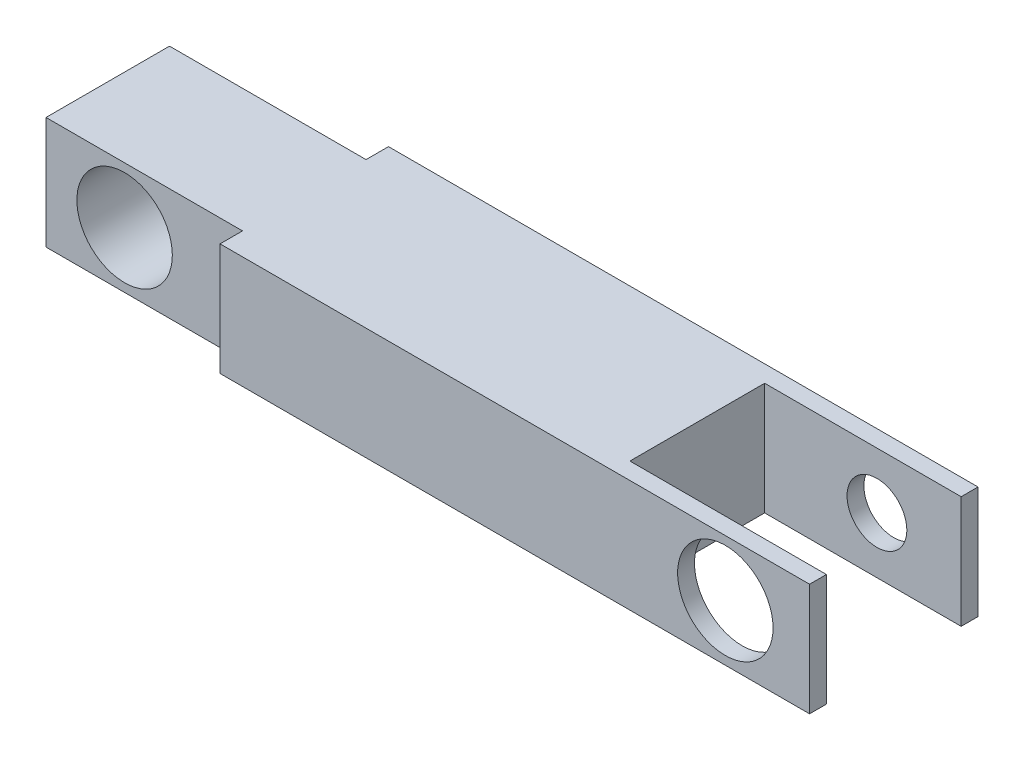
ISO-10303-21;
HEADER;
FILE_DESCRIPTION(('STEP AP214'),'2;1');
FILE_NAME('part.step','',(''),(''),'','','');
FILE_SCHEMA(('AUTOMOTIVE_DESIGN { 1 0 10303 214 1 1 1 1 }'));
ENDSEC;
DATA;
#1=APPLICATION_CONTEXT('core data for automotive mechanical design processes');
#2=APPLICATION_PROTOCOL_DEFINITION('international standard','automotive_design',2000,#1);
#3=PRODUCT_CONTEXT('',#1,'mechanical');
#4=PRODUCT('Part','Part','',(#3));
#5=PRODUCT_RELATED_PRODUCT_CATEGORY('part','',(#4));
#6=PRODUCT_DEFINITION_FORMATION('','',#4);
#7=PRODUCT_DEFINITION_CONTEXT('part definition',#1,'design');
#8=PRODUCT_DEFINITION('design','',#6,#7);
#9=PRODUCT_DEFINITION_SHAPE('','',#8);
#10=(LENGTH_UNIT() NAMED_UNIT(*) SI_UNIT(.MILLI.,.METRE.));
#11=(NAMED_UNIT(*) PLANE_ANGLE_UNIT() SI_UNIT($,.RADIAN.));
#12=(NAMED_UNIT(*) SI_UNIT($,.STERADIAN.) SOLID_ANGLE_UNIT());
#13=UNCERTAINTY_MEASURE_WITH_UNIT(LENGTH_MEASURE(1.E-05),#10,'distance_accuracy_value','');
#14=(GEOMETRIC_REPRESENTATION_CONTEXT(3) GLOBAL_UNCERTAINTY_ASSIGNED_CONTEXT((#13)) GLOBAL_UNIT_ASSIGNED_CONTEXT((#10,
#11,#12)) REPRESENTATION_CONTEXT('',''));
#15=CARTESIAN_POINT('',(0.,0.,0.));
#16=DIRECTION('',(0.,0.,1.));
#17=DIRECTION('',(1.,0.,0.));
#18=AXIS2_PLACEMENT_3D('',#15,#16,#17);
#19=CARTESIAN_POINT('',(-36.9598637191981,-2.27521749465176,7.62));
#20=DIRECTION('',(0.,-1.,0.));
#21=DIRECTION('',(1.,0.,0.));
#22=AXIS2_PLACEMENT_3D('',#19,#20,#21);
#23=PLANE('',#22);
#24=DIRECTION('',(1.,0.,0.));
#25=VECTOR('',#24,1.);
#26=CARTESIAN_POINT('',(0.,-2.27521749465176,6.858));
#27=LINE('',#26,#25);
#28=CARTESIAN_POINT('',(-45.8498637191981,-2.27521749465176,6.858));
#29=VERTEX_POINT('',#28);
#30=CARTESIAN_POINT('',(-36.9598637191981,-2.27521749465176,6.858));
#31=VERTEX_POINT('',#30);
#32=EDGE_CURVE('E137',#29,#31,#27,.T.);
#33=ORIENTED_EDGE('',*,*,#32,.F.);
#34=DIRECTION('',(0.,0.,1.));
#35=VECTOR('',#34,1.);
#36=CARTESIAN_POINT('',(-45.8498637191981,-2.27521749465176,0.));
#37=LINE('',#36,#35);
#38=CARTESIAN_POINT('',(-45.8498637191981,-2.27521749465176,0.761999999999998));
#39=VERTEX_POINT('',#38);
#40=EDGE_CURVE('E126',#39,#29,#37,.T.);
#41=ORIENTED_EDGE('',*,*,#40,.F.);
#42=DIRECTION('',(-1.,0.,0.));
#43=VECTOR('',#42,1.);
#44=CARTESIAN_POINT('',(0.,-2.27521749465176,0.762000000000001));
#45=LINE('',#44,#43);
#46=CARTESIAN_POINT('',(-36.9598637191981,-2.27521749465176,0.761999999999999));
#47=VERTEX_POINT('',#46);
#48=EDGE_CURVE('E136',#47,#39,#45,.T.);
#49=ORIENTED_EDGE('',*,*,#48,.F.);
#50=DIRECTION('',(0.,0.,-1.));
#51=VECTOR('',#50,1.);
#52=CARTESIAN_POINT('',(-36.9598637191981,-2.27521749465176,7.62));
#53=LINE('',#52,#51);
#54=CARTESIAN_POINT('',(-36.9598637191981,-2.27521749465176,0.));
#55=VERTEX_POINT('',#54);
#56=EDGE_CURVE('E208',#47,#55,#53,.T.);
#57=ORIENTED_EDGE('',*,*,#56,.T.);
#58=DIRECTION('',(-1.,0.,0.));
#59=VECTOR('',#58,1.);
#60=CARTESIAN_POINT('',(-36.9598637191981,-2.27521749465176,0.));
#61=LINE('',#60,#59);
#62=CARTESIAN_POINT('',(-63.6298637191981,-2.27521749465176,0.));
#63=VERTEX_POINT('',#62);
#64=EDGE_CURVE('E163',#55,#63,#61,.T.);
#65=ORIENTED_EDGE('',*,*,#64,.T.);
#66=DIRECTION('',(0.,0.,1.));
#67=VECTOR('',#66,1.);
#68=CARTESIAN_POINT('',(-63.6298637191981,-2.27521749465176,0.));
#69=LINE('',#68,#67);
#70=CARTESIAN_POINT('',(-63.6298637191981,-2.27521749465176,1.016));
#71=VERTEX_POINT('',#70);
#72=EDGE_CURVE('E167',#63,#71,#69,.T.);
#73=ORIENTED_EDGE('',*,*,#72,.T.);
#74=DIRECTION('',(-1.,0.,0.));
#75=VECTOR('',#74,1.);
#76=CARTESIAN_POINT('',(0.,-2.27521749465176,1.01600000000002));
#77=LINE('',#76,#75);
#78=CARTESIAN_POINT('',(-72.5198637191981,-2.27521749465176,1.016));
#79=VERTEX_POINT('',#78);
#80=EDGE_CURVE('E170',#71,#79,#77,.T.);
#81=ORIENTED_EDGE('',*,*,#80,.T.);
#82=DIRECTION('',(0.,0.,-1.));
#83=VECTOR('',#82,1.);
#84=CARTESIAN_POINT('',(-72.5198637191981,-2.27521749465176,7.62));
#85=LINE('',#84,#83);
#86=CARTESIAN_POINT('',(-72.5198637191981,-2.27521749465176,6.604));
#87=VERTEX_POINT('',#86);
#88=EDGE_CURVE('E12',#87,#79,#85,.T.);
#89=ORIENTED_EDGE('',*,*,#88,.F.);
#90=DIRECTION('',(1.,0.,0.));
#91=VECTOR('',#90,1.);
#92=CARTESIAN_POINT('',(0.,-2.27521749465176,6.604));
#93=LINE('',#92,#91);
#94=CARTESIAN_POINT('',(-63.6298637191981,-2.27521749465176,6.604));
#95=VERTEX_POINT('',#94);
#96=EDGE_CURVE('E185',#87,#95,#93,.T.);
#97=ORIENTED_EDGE('',*,*,#96,.T.);
#98=DIRECTION('',(0.,0.,1.));
#99=VECTOR('',#98,1.);
#100=CARTESIAN_POINT('',(-63.6298637191981,-2.27521749465176,0.));
#101=LINE('',#100,#99);
#102=CARTESIAN_POINT('',(-63.6298637191981,-2.27521749465176,7.62));
#103=VERTEX_POINT('',#102);
#104=EDGE_CURVE('E188',#95,#103,#101,.T.);
#105=ORIENTED_EDGE('',*,*,#104,.T.);
#106=DIRECTION('',(-1.,0.,0.));
#107=VECTOR('',#106,1.);
#108=CARTESIAN_POINT('',(-36.9598637191981,-2.27521749465176,7.62));
#109=LINE('',#108,#107);
#110=CARTESIAN_POINT('',(-36.9598637191981,-2.27521749465176,7.62));
#111=VERTEX_POINT('',#110);
#112=EDGE_CURVE('E200',#111,#103,#109,.T.);
#113=ORIENTED_EDGE('',*,*,#112,.F.);
#114=EDGE_CURVE('E149',#111,#31,#53,.T.);
#115=ORIENTED_EDGE('',*,*,#114,.T.);
#116=EDGE_LOOP('',(#33,#41,#49,#57,#65,#73,#81,#89,#97,#105,#113,#115));
#117=FACE_BOUND('',#116,.T.);
#118=ADVANCED_FACE('F38',(#117),#23,.F.);
#119=CARTESIAN_POINT('',(-72.5198637191981,-7.35521749465176,7.62));
#120=DIRECTION('',(0.,1.,0.));
#121=DIRECTION('',(0.,0.,1.));
#122=AXIS2_PLACEMENT_3D('',#119,#120,#121);
#123=PLANE('',#122);
#124=DIRECTION('',(1.,0.,0.));
#125=VECTOR('',#124,1.);
#126=CARTESIAN_POINT('',(0.,-7.35521749465176,6.858));
#127=LINE('',#126,#125);
#128=CARTESIAN_POINT('',(-45.8498637191981,-7.35521749465176,6.858));
#129=VERTEX_POINT('',#128);
#130=CARTESIAN_POINT('',(-36.9598637191981,-7.35521749465176,6.858));
#131=VERTEX_POINT('',#130);
#132=EDGE_CURVE('E143',#129,#131,#127,.T.);
#133=ORIENTED_EDGE('',*,*,#132,.T.);
#134=DIRECTION('',(0.,0.,-1.));
#135=VECTOR('',#134,1.);
#136=CARTESIAN_POINT('',(-36.9598637191981,-7.35521749465176,7.62));
#137=LINE('',#136,#135);
#138=CARTESIAN_POINT('',(-36.9598637191981,-7.35521749465176,7.62));
#139=VERTEX_POINT('',#138);
#140=EDGE_CURVE('E218',#139,#131,#137,.T.);
#141=ORIENTED_EDGE('',*,*,#140,.F.);
#142=DIRECTION('',(1.,0.,0.));
#143=VECTOR('',#142,1.);
#144=CARTESIAN_POINT('',(-72.5198637191981,-7.35521749465176,7.62));
#145=LINE('',#144,#143);
#146=CARTESIAN_POINT('',(-63.6298637191981,-7.35521749465176,7.62));
#147=VERTEX_POINT('',#146);
#148=EDGE_CURVE('E203',#147,#139,#145,.T.);
#149=ORIENTED_EDGE('',*,*,#148,.F.);
#150=DIRECTION('',(0.,0.,1.));
#151=VECTOR('',#150,1.);
#152=CARTESIAN_POINT('',(-63.6298637191981,-7.35521749465176,0.));
#153=LINE('',#152,#151);
#154=CARTESIAN_POINT('',(-63.6298637191981,-7.35521749465176,6.604));
#155=VERTEX_POINT('',#154);
#156=EDGE_CURVE('E60',#155,#147,#153,.T.);
#157=ORIENTED_EDGE('',*,*,#156,.F.);
#158=DIRECTION('',(1.,0.,0.));
#159=VECTOR('',#158,1.);
#160=CARTESIAN_POINT('',(0.,-7.35521749465176,6.604));
#161=LINE('',#160,#159);
#162=CARTESIAN_POINT('',(-72.5198637191981,-7.35521749465176,6.604));
#163=VERTEX_POINT('',#162);
#164=EDGE_CURVE('E192',#163,#155,#161,.T.);
#165=ORIENTED_EDGE('',*,*,#164,.F.);
#166=DIRECTION('',(0.,0.,-1.));
#167=VECTOR('',#166,1.);
#168=CARTESIAN_POINT('',(-72.5198637191981,-7.35521749465176,7.62));
#169=LINE('',#168,#167);
#170=CARTESIAN_POINT('',(-72.5198637191981,-7.35521749465176,1.016));
#171=VERTEX_POINT('',#170);
#172=EDGE_CURVE('E45',#163,#171,#169,.T.);
#173=ORIENTED_EDGE('',*,*,#172,.T.);
#174=DIRECTION('',(-1.,0.,0.));
#175=VECTOR('',#174,1.);
#176=CARTESIAN_POINT('',(0.,-7.35521749465176,1.01600000000002));
#177=LINE('',#176,#175);
#178=CARTESIAN_POINT('',(-63.6298637191981,-7.35521749465176,1.016));
#179=VERTEX_POINT('',#178);
#180=EDGE_CURVE('E171',#179,#171,#177,.T.);
#181=ORIENTED_EDGE('',*,*,#180,.F.);
#182=DIRECTION('',(0.,0.,1.));
#183=VECTOR('',#182,1.);
#184=CARTESIAN_POINT('',(-63.6298637191981,-7.35521749465176,0.));
#185=LINE('',#184,#183);
#186=CARTESIAN_POINT('',(-63.6298637191981,-7.35521749465176,0.));
#187=VERTEX_POINT('',#186);
#188=EDGE_CURVE('E175',#187,#179,#185,.T.);
#189=ORIENTED_EDGE('',*,*,#188,.F.);
#190=DIRECTION('',(1.,0.,0.));
#191=VECTOR('',#190,1.);
#192=CARTESIAN_POINT('',(-72.5198637191981,-7.35521749465176,0.));
#193=LINE('',#192,#191);
#194=CARTESIAN_POINT('',(-36.9598637191981,-7.35521749465176,0.));
#195=VERTEX_POINT('',#194);
#196=EDGE_CURVE('E211',#187,#195,#193,.T.);
#197=ORIENTED_EDGE('',*,*,#196,.T.);
#198=CARTESIAN_POINT('',(-36.9598637191981,-7.35521749465176,0.762));
#199=VERTEX_POINT('',#198);
#200=EDGE_CURVE('E217',#199,#195,#137,.T.);
#201=ORIENTED_EDGE('',*,*,#200,.F.);
#202=DIRECTION('',(-1.,0.,0.));
#203=VECTOR('',#202,1.);
#204=CARTESIAN_POINT('',(0.,-7.35521749465176,0.762000000000001));
#205=LINE('',#204,#203);
#206=CARTESIAN_POINT('',(-45.8498637191981,-7.35521749465176,0.761999999999998));
#207=VERTEX_POINT('',#206);
#208=EDGE_CURVE('E52',#199,#207,#205,.T.);
#209=ORIENTED_EDGE('',*,*,#208,.T.);
#210=DIRECTION('',(0.,0.,1.));
#211=VECTOR('',#210,1.);
#212=CARTESIAN_POINT('',(-45.8498637191981,-7.35521749465176,0.));
#213=LINE('',#212,#211);
#214=EDGE_CURVE('E151',#207,#129,#213,.T.);
#215=ORIENTED_EDGE('',*,*,#214,.T.);
#216=EDGE_LOOP('',(#133,#141,#149,#157,#165,#173,#181,#189,#197,#201,#209,#215));
#217=FACE_BOUND('',#216,.T.);
#218=ADVANCED_FACE('F225',(#217),#123,.F.);
#219=CARTESIAN_POINT('',(-36.9598637191981,-7.35521749465176,7.62));
#220=DIRECTION('',(-1.,0.,0.));
#221=DIRECTION('',(0.,0.,1.));
#222=AXIS2_PLACEMENT_3D('',#219,#220,#221);
#223=PLANE('',#222);
#224=DIRECTION('',(0.,-1.,0.));
#225=VECTOR('',#224,1.);
#226=CARTESIAN_POINT('',(-36.9598637191981,-2.27521749465176,6.858));
#227=LINE('',#226,#225);
#228=EDGE_CURVE('E161',#31,#131,#227,.T.);
#229=ORIENTED_EDGE('',*,*,#228,.F.);
#230=ORIENTED_EDGE('',*,*,#114,.F.);
#231=DIRECTION('',(0.,1.,0.));
#232=VECTOR('',#231,1.);
#233=CARTESIAN_POINT('',(-36.9598637191981,-7.35521749465176,7.62));
#234=LINE('',#233,#232);
#235=EDGE_CURVE('E206',#139,#111,#234,.T.);
#236=ORIENTED_EDGE('',*,*,#235,.F.);
#237=ORIENTED_EDGE('',*,*,#140,.T.);
#238=EDGE_LOOP('',(#229,#230,#236,#237));
#239=FACE_BOUND('',#238,.T.);
#240=ADVANCED_FACE('F251',(#239),#223,.F.);
#241=DIRECTION('',(0.,-1.,0.));
#242=VECTOR('',#241,1.);
#243=CARTESIAN_POINT('',(-36.9598637191981,-2.27521749465176,0.761999999999999));
#244=LINE('',#243,#242);
#245=EDGE_CURVE('E164',#47,#199,#244,.T.);
#246=ORIENTED_EDGE('',*,*,#245,.T.);
#247=ORIENTED_EDGE('',*,*,#200,.T.);
#248=DIRECTION('',(0.,1.,0.));
#249=VECTOR('',#248,1.);
#250=CARTESIAN_POINT('',(-36.9598637191981,-7.35521749465176,0.));
#251=LINE('',#250,#249);
#252=EDGE_CURVE('E204',#195,#55,#251,.T.);
#253=ORIENTED_EDGE('',*,*,#252,.T.);
#254=ORIENTED_EDGE('',*,*,#56,.F.);
#255=EDGE_LOOP('',(#246,#247,#253,#254));
#256=FACE_BOUND('',#255,.T.);
#257=ADVANCED_FACE('F244',(#256),#223,.F.);
#258=CARTESIAN_POINT('',(-72.5198637191981,-2.27521749465176,7.62));
#259=DIRECTION('',(1.,0.,0.));
#260=DIRECTION('',(0.,0.,-1.));
#261=AXIS2_PLACEMENT_3D('',#258,#259,#260);
#262=PLANE('',#261);
#263=ORIENTED_EDGE('',*,*,#88,.T.);
#264=DIRECTION('',(0.,-1.,0.));
#265=VECTOR('',#264,1.);
#266=CARTESIAN_POINT('',(-72.5198637191981,-2.27521749465176,1.016));
#267=LINE('',#266,#265);
#268=EDGE_CURVE('E181',#79,#171,#267,.T.);
#269=ORIENTED_EDGE('',*,*,#268,.T.);
#270=ORIENTED_EDGE('',*,*,#172,.F.);
#271=DIRECTION('',(0.,-1.,0.));
#272=VECTOR('',#271,1.);
#273=CARTESIAN_POINT('',(-72.5198637191981,-2.27521749465176,6.604));
#274=LINE('',#273,#272);
#275=EDGE_CURVE('E178',#87,#163,#274,.T.);
#276=ORIENTED_EDGE('',*,*,#275,.F.);
#277=EDGE_LOOP('',(#263,#269,#270,#276));
#278=FACE_BOUND('',#277,.T.);
#279=ADVANCED_FACE('F229',(#278),#262,.F.);
#280=CARTESIAN_POINT('',(0.,0.,7.62));
#281=DIRECTION('',(0.,0.,1.));
#282=DIRECTION('',(1.,0.,0.));
#283=AXIS2_PLACEMENT_3D('',#280,#281,#282);
#284=PLANE('',#283);
#285=CARTESIAN_POINT('',(-40.7698637191981,-4.81521749465176,7.62));
#286=DIRECTION('',(0.,0.,1.));
#287=DIRECTION('',(1.,0.,0.));
#288=AXIS2_PLACEMENT_3D('',#285,#286,#287);
#289=CIRCLE('',#288,2.159);
#290=CARTESIAN_POINT('',(-38.6108637191981,-4.81521749465176,7.62));
#291=VERTEX_POINT('',#290);
#292=EDGE_CURVE('E154',#291,#291,#289,.T.);
#293=ORIENTED_EDGE('',*,*,#292,.F.);
#294=EDGE_LOOP('',(#293));
#295=FACE_BOUND('',#294,.T.);
#296=DIRECTION('',(0.,-1.,0.));
#297=VECTOR('',#296,1.);
#298=CARTESIAN_POINT('',(-63.6298637191981,-2.27521749465176,7.62));
#299=LINE('',#298,#297);
#300=EDGE_CURVE('E197',#103,#147,#299,.T.);
#301=ORIENTED_EDGE('',*,*,#300,.T.);
#302=ORIENTED_EDGE('',*,*,#148,.T.);
#303=ORIENTED_EDGE('',*,*,#235,.T.);
#304=ORIENTED_EDGE('',*,*,#112,.T.);
#305=EDGE_LOOP('',(#301,#302,#303,#304));
#306=FACE_BOUND('',#305,.T.);
#307=ADVANCED_FACE('F253',(#295,#306),#284,.T.);
#308=CARTESIAN_POINT('',(0.,0.,0.));
#309=DIRECTION('',(0.,0.,1.));
#310=DIRECTION('',(1.,0.,0.));
#311=AXIS2_PLACEMENT_3D('',#308,#309,#310);
#312=PLANE('',#311);
#313=CARTESIAN_POINT('',(-40.7698637191981,-4.81521749465176,0.));
#314=DIRECTION('',(0.,0.,-1.));
#315=DIRECTION('',(-1.,0.,0.));
#316=AXIS2_PLACEMENT_3D('',#313,#314,#315);
#317=CIRCLE('',#316,1.35254999999999);
#318=CARTESIAN_POINT('',(-42.1224137191981,-4.81521749465176,0.));
#319=VERTEX_POINT('',#318);
#320=EDGE_CURVE('E387',#319,#319,#317,.T.);
#321=ORIENTED_EDGE('',*,*,#320,.F.);
#322=EDGE_LOOP('',(#321));
#323=FACE_BOUND('',#322,.T.);
#324=ORIENTED_EDGE('',*,*,#196,.F.);
#325=DIRECTION('',(0.,-1.,0.));
#326=VECTOR('',#325,1.);
#327=CARTESIAN_POINT('',(-63.6298637191981,-2.27521749465176,0.));
#328=LINE('',#327,#326);
#329=EDGE_CURVE('E159',#63,#187,#328,.T.);
#330=ORIENTED_EDGE('',*,*,#329,.F.);
#331=ORIENTED_EDGE('',*,*,#64,.F.);
#332=ORIENTED_EDGE('',*,*,#252,.F.);
#333=EDGE_LOOP('',(#324,#330,#331,#332));
#334=FACE_BOUND('',#333,.T.);
#335=ADVANCED_FACE('F240',(#323,#334),#312,.F.);
#336=CARTESIAN_POINT('',(-63.6298637191981,-2.27521749465176,0.));
#337=DIRECTION('',(1.,0.,0.));
#338=DIRECTION('',(0.,0.,-1.));
#339=AXIS2_PLACEMENT_3D('',#336,#337,#338);
#340=PLANE('',#339);
#341=ORIENTED_EDGE('',*,*,#188,.T.);
#342=DIRECTION('',(0.,-1.,0.));
#343=VECTOR('',#342,1.);
#344=CARTESIAN_POINT('',(-63.6298637191981,-2.27521749465176,1.016));
#345=LINE('',#344,#343);
#346=EDGE_CURVE('E174',#71,#179,#345,.T.);
#347=ORIENTED_EDGE('',*,*,#346,.F.);
#348=ORIENTED_EDGE('',*,*,#72,.F.);
#349=ORIENTED_EDGE('',*,*,#329,.T.);
#350=EDGE_LOOP('',(#341,#347,#348,#349));
#351=FACE_BOUND('',#350,.T.);
#352=ADVANCED_FACE('F237',(#351),#340,.F.);
#353=CARTESIAN_POINT('',(0.,-2.27521749465176,1.01600000000002));
#354=DIRECTION('',(0.,0.,1.));
#355=DIRECTION('',(1.,0.,0.));
#356=AXIS2_PLACEMENT_3D('',#353,#354,#355);
#357=PLANE('',#356);
#358=CARTESIAN_POINT('',(-68.9638637191981,-4.81521749465176,1.016));
#359=DIRECTION('',(0.,0.,1.));
#360=DIRECTION('',(1.,0.,0.));
#361=AXIS2_PLACEMENT_3D('',#358,#359,#360);
#362=CIRCLE('',#361,2.15899999999999);
#363=CARTESIAN_POINT('',(-66.8048637191982,-4.81521749465176,1.016));
#364=VERTEX_POINT('',#363);
#365=EDGE_CURVE('E394',#364,#364,#362,.T.);
#366=ORIENTED_EDGE('',*,*,#365,.T.);
#367=EDGE_LOOP('',(#366));
#368=FACE_BOUND('',#367,.T.);
#369=ORIENTED_EDGE('',*,*,#180,.T.);
#370=ORIENTED_EDGE('',*,*,#268,.F.);
#371=ORIENTED_EDGE('',*,*,#80,.F.);
#372=ORIENTED_EDGE('',*,*,#346,.T.);
#373=EDGE_LOOP('',(#369,#370,#371,#372));
#374=FACE_BOUND('',#373,.T.);
#375=ADVANCED_FACE('F233',(#368,#374),#357,.F.);
#376=CARTESIAN_POINT('',(0.,-2.27521749465176,6.604));
#377=DIRECTION('',(0.,0.,-1.));
#378=DIRECTION('',(-1.,0.,0.));
#379=AXIS2_PLACEMENT_3D('',#376,#377,#378);
#380=PLANE('',#379);
#381=CARTESIAN_POINT('',(-68.9638637191981,-4.81521749465176,6.604));
#382=DIRECTION('',(0.,0.,1.));
#383=DIRECTION('',(1.,0.,0.));
#384=AXIS2_PLACEMENT_3D('',#381,#382,#383);
#385=CIRCLE('',#384,2.15899999999999);
#386=CARTESIAN_POINT('',(-66.8048637191982,-4.81521749465176,6.604));
#387=VERTEX_POINT('',#386);
#388=EDGE_CURVE('E391',#387,#387,#385,.T.);
#389=ORIENTED_EDGE('',*,*,#388,.F.);
#390=EDGE_LOOP('',(#389));
#391=FACE_BOUND('',#390,.T.);
#392=ORIENTED_EDGE('',*,*,#164,.T.);
#393=DIRECTION('',(0.,-1.,0.));
#394=VECTOR('',#393,1.);
#395=CARTESIAN_POINT('',(-63.6298637191981,-2.27521749465176,6.604));
#396=LINE('',#395,#394);
#397=EDGE_CURVE('E191',#95,#155,#396,.T.);
#398=ORIENTED_EDGE('',*,*,#397,.F.);
#399=ORIENTED_EDGE('',*,*,#96,.F.);
#400=ORIENTED_EDGE('',*,*,#275,.T.);
#401=EDGE_LOOP('',(#392,#398,#399,#400));
#402=FACE_BOUND('',#401,.T.);
#403=ADVANCED_FACE('F257',(#391,#402),#380,.F.);
#404=CARTESIAN_POINT('',(-63.6298637191981,-2.27521749465176,0.));
#405=DIRECTION('',(1.,0.,0.));
#406=DIRECTION('',(0.,0.,-1.));
#407=AXIS2_PLACEMENT_3D('',#404,#405,#406);
#408=PLANE('',#407);
#409=ORIENTED_EDGE('',*,*,#156,.T.);
#410=ORIENTED_EDGE('',*,*,#300,.F.);
#411=ORIENTED_EDGE('',*,*,#104,.F.);
#412=ORIENTED_EDGE('',*,*,#397,.T.);
#413=EDGE_LOOP('',(#409,#410,#411,#412));
#414=FACE_BOUND('',#413,.T.);
#415=ADVANCED_FACE('F255',(#414),#408,.F.);
#416=CARTESIAN_POINT('',(0.,-2.27521749465176,6.858));
#417=DIRECTION('',(0.,0.,-1.));
#418=DIRECTION('',(-1.,0.,0.));
#419=AXIS2_PLACEMENT_3D('',#416,#417,#418);
#420=PLANE('',#419);
#421=CARTESIAN_POINT('',(-40.7698637191981,-4.81521749465176,6.858));
#422=DIRECTION('',(0.,0.,-1.));
#423=DIRECTION('',(-1.,0.,0.));
#424=AXIS2_PLACEMENT_3D('',#421,#422,#423);
#425=CIRCLE('',#424,2.159);
#426=CARTESIAN_POINT('',(-42.9288637191981,-4.81521749465176,6.858));
#427=VERTEX_POINT('',#426);
#428=EDGE_CURVE('E399',#427,#427,#425,.F.);
#429=ORIENTED_EDGE('',*,*,#428,.T.);
#430=EDGE_LOOP('',(#429));
#431=FACE_BOUND('',#430,.T.);
#432=ORIENTED_EDGE('',*,*,#132,.F.);
#433=DIRECTION('',(0.,-1.,0.));
#434=VECTOR('',#433,1.);
#435=CARTESIAN_POINT('',(-45.8498637191981,-2.27521749465176,6.858));
#436=LINE('',#435,#434);
#437=EDGE_CURVE('E130',#29,#129,#436,.T.);
#438=ORIENTED_EDGE('',*,*,#437,.F.);
#439=ORIENTED_EDGE('',*,*,#32,.T.);
#440=ORIENTED_EDGE('',*,*,#228,.T.);
#441=EDGE_LOOP('',(#432,#438,#439,#440));
#442=FACE_BOUND('',#441,.T.);
#443=ADVANCED_FACE('F140',(#431,#442),#420,.T.);
#444=CARTESIAN_POINT('',(0.,-2.27521749465176,0.762000000000001));
#445=DIRECTION('',(0.,0.,1.));
#446=DIRECTION('',(1.,0.,0.));
#447=AXIS2_PLACEMENT_3D('',#444,#445,#446);
#448=PLANE('',#447);
#449=CARTESIAN_POINT('',(-40.7698637191981,-4.81521749465176,0.761999999999999));
#450=DIRECTION('',(0.,0.,1.));
#451=DIRECTION('',(1.,0.,0.));
#452=AXIS2_PLACEMENT_3D('',#449,#450,#451);
#453=CIRCLE('',#452,1.35254999999999);
#454=CARTESIAN_POINT('',(-39.4173137191981,-4.81521749465176,0.761999999999999));
#455=VERTEX_POINT('',#454);
#456=EDGE_CURVE('E390',#455,#455,#453,.T.);
#457=ORIENTED_EDGE('',*,*,#456,.F.);
#458=EDGE_LOOP('',(#457));
#459=FACE_BOUND('',#458,.T.);
#460=ORIENTED_EDGE('',*,*,#208,.F.);
#461=ORIENTED_EDGE('',*,*,#245,.F.);
#462=ORIENTED_EDGE('',*,*,#48,.T.);
#463=DIRECTION('',(0.,-1.,0.));
#464=VECTOR('',#463,1.);
#465=CARTESIAN_POINT('',(-45.8498637191981,-2.27521749465176,0.761999999999998));
#466=LINE('',#465,#464);
#467=EDGE_CURVE('E132',#39,#207,#466,.T.);
#468=ORIENTED_EDGE('',*,*,#467,.T.);
#469=EDGE_LOOP('',(#460,#461,#462,#468));
#470=FACE_BOUND('',#469,.T.);
#471=ADVANCED_FACE('F246',(#459,#470),#448,.T.);
#472=CARTESIAN_POINT('',(-45.8498637191981,-2.27521749465176,0.));
#473=DIRECTION('',(1.,0.,0.));
#474=DIRECTION('',(0.,0.,-1.));
#475=AXIS2_PLACEMENT_3D('',#472,#473,#474);
#476=PLANE('',#475);
#477=ORIENTED_EDGE('',*,*,#214,.F.);
#478=ORIENTED_EDGE('',*,*,#467,.F.);
#479=ORIENTED_EDGE('',*,*,#40,.T.);
#480=ORIENTED_EDGE('',*,*,#437,.T.);
#481=EDGE_LOOP('',(#477,#478,#479,#480));
#482=FACE_BOUND('',#481,.T.);
#483=ADVANCED_FACE('F129',(#482),#476,.T.);
#484=CARTESIAN_POINT('',(-40.7698637191981,-4.81521749465176,-0.00100000000000013));
#485=DIRECTION('',(0.,0.,1.));
#486=DIRECTION('',(1.,0.,0.));
#487=AXIS2_PLACEMENT_3D('',#484,#485,#486);
#488=CYLINDRICAL_SURFACE('',#487,2.159);
#489=ORIENTED_EDGE('',*,*,#428,.F.);
#490=EDGE_LOOP('',(#489));
#491=FACE_BOUND('',#490,.T.);
#492=ORIENTED_EDGE('',*,*,#292,.T.);
#493=EDGE_LOOP('',(#492));
#494=FACE_BOUND('',#493,.T.);
#495=ADVANCED_FACE('F352',(#491,#494),#488,.F.);
#496=CARTESIAN_POINT('',(-68.9638637191981,-4.81521749465176,0.));
#497=DIRECTION('',(0.,0.,1.));
#498=DIRECTION('',(1.,0.,0.));
#499=AXIS2_PLACEMENT_3D('',#496,#497,#498);
#500=CYLINDRICAL_SURFACE('',#499,2.15899999999999);
#501=ORIENTED_EDGE('',*,*,#388,.T.);
#502=EDGE_LOOP('',(#501));
#503=FACE_BOUND('',#502,.T.);
#504=ORIENTED_EDGE('',*,*,#365,.F.);
#505=EDGE_LOOP('',(#504));
#506=FACE_BOUND('',#505,.T.);
#507=ADVANCED_FACE('F359',(#503,#506),#500,.F.);
#508=CARTESIAN_POINT('',(-40.7698637191981,-4.81521749465176,0.));
#509=DIRECTION('',(0.,0.,-1.));
#510=DIRECTION('',(-1.,0.,0.));
#511=AXIS2_PLACEMENT_3D('',#508,#509,#510);
#512=CYLINDRICAL_SURFACE('',#511,1.35254999999999);
#513=ORIENTED_EDGE('',*,*,#320,.T.);
#514=EDGE_LOOP('',(#513));
#515=FACE_BOUND('',#514,.T.);
#516=ORIENTED_EDGE('',*,*,#456,.T.);
#517=EDGE_LOOP('',(#516));
#518=FACE_BOUND('',#517,.T.);
#519=ADVANCED_FACE('F367',(#515,#518),#512,.F.);
#520=CLOSED_SHELL('',(#118,#218,#240,#257,#279,#307,#335,#352,#375,#403,#415,#443,#471,#483,
#495,#507,#519));
#521=MANIFOLD_SOLID_BREP('B2',#520);
#522=ADVANCED_BREP_SHAPE_REPRESENTATION('',(#18,#521),#14);
#523=SHAPE_DEFINITION_REPRESENTATION(#9,#522);
ENDSEC;
END-ISO-10303-21;
